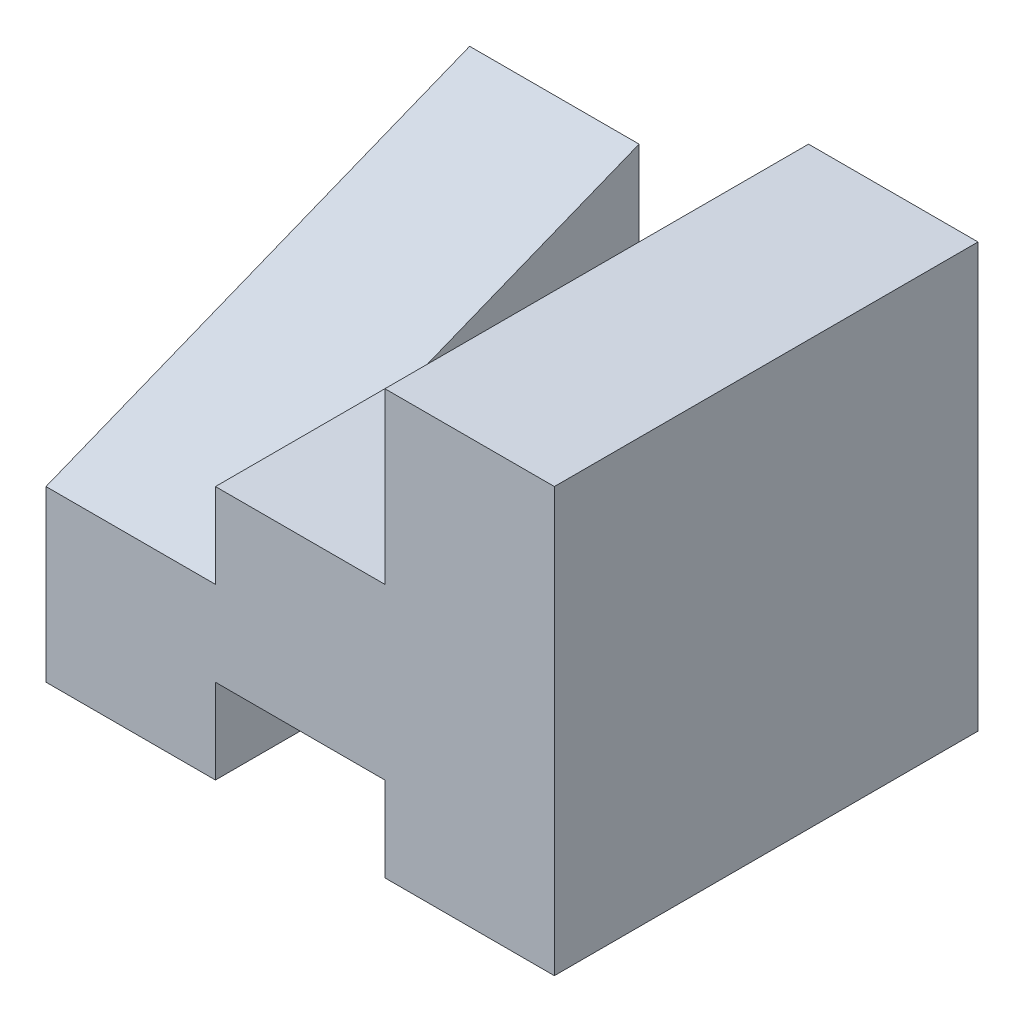
ISO-10303-21;
HEADER;
FILE_DESCRIPTION(('STEP AP214'),'2;1');
FILE_NAME('part.step','',(''),(''),'','','');
FILE_SCHEMA(('AUTOMOTIVE_DESIGN { 1 0 10303 214 1 1 1 1 }'));
ENDSEC;
DATA;
#1=APPLICATION_CONTEXT('core data for automotive mechanical design processes');
#2=APPLICATION_PROTOCOL_DEFINITION('international standard','automotive_design',2000,#1);
#3=PRODUCT_CONTEXT('',#1,'mechanical');
#4=PRODUCT('Part','Part','',(#3));
#5=PRODUCT_RELATED_PRODUCT_CATEGORY('part','',(#4));
#6=PRODUCT_DEFINITION_FORMATION('','',#4);
#7=PRODUCT_DEFINITION_CONTEXT('part definition',#1,'design');
#8=PRODUCT_DEFINITION('design','',#6,#7);
#9=PRODUCT_DEFINITION_SHAPE('','',#8);
#10=(LENGTH_UNIT() NAMED_UNIT(*) SI_UNIT(.MILLI.,.METRE.));
#11=(NAMED_UNIT(*) PLANE_ANGLE_UNIT() SI_UNIT($,.RADIAN.));
#12=(NAMED_UNIT(*) SI_UNIT($,.STERADIAN.) SOLID_ANGLE_UNIT());
#13=UNCERTAINTY_MEASURE_WITH_UNIT(LENGTH_MEASURE(1.E-05),#10,'distance_accuracy_value','');
#14=(GEOMETRIC_REPRESENTATION_CONTEXT(3) GLOBAL_UNCERTAINTY_ASSIGNED_CONTEXT((#13)) GLOBAL_UNIT_ASSIGNED_CONTEXT((#10,
#11,#12)) REPRESENTATION_CONTEXT('',''));
#15=CARTESIAN_POINT('',(0.,0.,0.));
#16=DIRECTION('',(0.,0.,1.));
#17=DIRECTION('',(1.,0.,0.));
#18=AXIS2_PLACEMENT_3D('',#15,#16,#17);
#19=CARTESIAN_POINT('',(-20.,10.,25.));
#20=DIRECTION('',(1.,0.,0.));
#21=DIRECTION('',(0.,0.,-1.));
#22=AXIS2_PLACEMENT_3D('',#19,#20,#21);
#23=PLANE('',#22);
#24=DIRECTION('',(0.,0.371390676354104,-0.928476690885259));
#25=VECTOR('',#24,1.);
#26=CARTESIAN_POINT('',(-20.,20.,0.));
#27=LINE('',#26,#25);
#28=CARTESIAN_POINT('',(-20.,10.,25.));
#29=VERTEX_POINT('',#28);
#30=CARTESIAN_POINT('',(-20.,15.,12.5));
#31=VERTEX_POINT('',#30);
#32=EDGE_CURVE('E145',#29,#31,#27,.T.);
#33=ORIENTED_EDGE('',*,*,#32,.F.);
#34=DIRECTION('',(0.,-1.,0.));
#35=VECTOR('',#34,1.);
#36=CARTESIAN_POINT('',(-20.,10.,25.));
#37=LINE('',#36,#35);
#38=CARTESIAN_POINT('',(-20.,15.,25.));
#39=VERTEX_POINT('',#38);
#40=EDGE_CURVE('E133',#39,#29,#37,.T.);
#41=ORIENTED_EDGE('',*,*,#40,.F.);
#42=DIRECTION('',(0.,0.,-1.));
#43=VECTOR('',#42,1.);
#44=CARTESIAN_POINT('',(-20.,15.,25.));
#45=LINE('',#44,#43);
#46=EDGE_CURVE('E138',#39,#31,#45,.T.);
#47=ORIENTED_EDGE('',*,*,#46,.T.);
#48=EDGE_LOOP('',(#33,#41,#47));
#49=FACE_BOUND('',#48,.T.);
#50=ADVANCED_FACE('F33',(#49),#23,.F.);
#51=CARTESIAN_POINT('',(-30.,0.,25.));
#52=DIRECTION('',(1.,0.,0.));
#53=DIRECTION('',(0.,0.,-1.));
#54=AXIS2_PLACEMENT_3D('',#51,#52,#53);
#55=PLANE('',#54);
#56=DIRECTION('',(0.,-1.,0.));
#57=VECTOR('',#56,1.);
#58=CARTESIAN_POINT('',(-30.,0.,0.));
#59=LINE('',#58,#57);
#60=CARTESIAN_POINT('',(-30.,20.,0.));
#61=VERTEX_POINT('',#60);
#62=CARTESIAN_POINT('',(-30.,0.,0.));
#63=VERTEX_POINT('',#62);
#64=EDGE_CURVE('E150',#61,#63,#59,.T.);
#65=ORIENTED_EDGE('',*,*,#64,.T.);
#66=DIRECTION('',(0.,0.,-1.));
#67=VECTOR('',#66,1.);
#68=CARTESIAN_POINT('',(-30.,0.,25.));
#69=LINE('',#68,#67);
#70=CARTESIAN_POINT('',(-30.,0.,25.));
#71=VERTEX_POINT('',#70);
#72=EDGE_CURVE('E11',#71,#63,#69,.T.);
#73=ORIENTED_EDGE('',*,*,#72,.F.);
#74=DIRECTION('',(0.,-1.,0.));
#75=VECTOR('',#74,1.);
#76=CARTESIAN_POINT('',(-30.,0.,25.));
#77=LINE('',#76,#75);
#78=CARTESIAN_POINT('',(-30.,10.,25.));
#79=VERTEX_POINT('',#78);
#80=EDGE_CURVE('E169',#79,#71,#77,.T.);
#81=ORIENTED_EDGE('',*,*,#80,.F.);
#82=DIRECTION('',(0.,0.371390676354104,-0.928476690885259));
#83=VECTOR('',#82,1.);
#84=CARTESIAN_POINT('',(-30.,20.,0.));
#85=LINE('',#84,#83);
#86=EDGE_CURVE('E239',#79,#61,#85,.T.);
#87=ORIENTED_EDGE('',*,*,#86,.T.);
#88=EDGE_LOOP('',(#65,#73,#81,#87));
#89=FACE_BOUND('',#88,.T.);
#90=ADVANCED_FACE('F35',(#89),#55,.F.);
#91=CARTESIAN_POINT('',(-20.,0.,25.));
#92=DIRECTION('',(0.,1.,0.));
#93=DIRECTION('',(-1.,0.,0.));
#94=AXIS2_PLACEMENT_3D('',#91,#92,#93);
#95=PLANE('',#94);
#96=DIRECTION('',(1.,0.,0.));
#97=VECTOR('',#96,1.);
#98=CARTESIAN_POINT('',(-20.,0.,0.));
#99=LINE('',#98,#97);
#100=CARTESIAN_POINT('',(-20.,0.,0.));
#101=VERTEX_POINT('',#100);
#102=EDGE_CURVE('E153',#63,#101,#99,.T.);
#103=ORIENTED_EDGE('',*,*,#102,.T.);
#104=DIRECTION('',(0.,0.,-1.));
#105=VECTOR('',#104,1.);
#106=CARTESIAN_POINT('',(-20.,0.,25.));
#107=LINE('',#106,#105);
#108=CARTESIAN_POINT('',(-20.,0.,25.));
#109=VERTEX_POINT('',#108);
#110=EDGE_CURVE('E41',#109,#101,#107,.T.);
#111=ORIENTED_EDGE('',*,*,#110,.F.);
#112=DIRECTION('',(1.,0.,0.));
#113=VECTOR('',#112,1.);
#114=CARTESIAN_POINT('',(-20.,0.,25.));
#115=LINE('',#114,#113);
#116=EDGE_CURVE('E102',#71,#109,#115,.T.);
#117=ORIENTED_EDGE('',*,*,#116,.F.);
#118=ORIENTED_EDGE('',*,*,#72,.T.);
#119=EDGE_LOOP('',(#103,#111,#117,#118));
#120=FACE_BOUND('',#119,.T.);
#121=ADVANCED_FACE('F252',(#120),#95,.F.);
#122=CARTESIAN_POINT('',(-20.,5.,25.));
#123=DIRECTION('',(-1.,0.,0.));
#124=DIRECTION('',(0.,0.,1.));
#125=AXIS2_PLACEMENT_3D('',#122,#123,#124);
#126=PLANE('',#125);
#127=DIRECTION('',(0.,1.,0.));
#128=VECTOR('',#127,1.);
#129=CARTESIAN_POINT('',(-20.,5.,0.));
#130=LINE('',#129,#128);
#131=CARTESIAN_POINT('',(-20.,5.,0.));
#132=VERTEX_POINT('',#131);
#133=EDGE_CURVE('E155',#101,#132,#130,.T.);
#134=ORIENTED_EDGE('',*,*,#133,.T.);
#135=DIRECTION('',(0.,0.,-1.));
#136=VECTOR('',#135,1.);
#137=CARTESIAN_POINT('',(-20.,5.,25.));
#138=LINE('',#137,#136);
#139=CARTESIAN_POINT('',(-20.,5.,25.));
#140=VERTEX_POINT('',#139);
#141=EDGE_CURVE('E187',#140,#132,#138,.T.);
#142=ORIENTED_EDGE('',*,*,#141,.F.);
#143=DIRECTION('',(0.,1.,0.));
#144=VECTOR('',#143,1.);
#145=CARTESIAN_POINT('',(-20.,5.,25.));
#146=LINE('',#145,#144);
#147=EDGE_CURVE('E195',#109,#140,#146,.T.);
#148=ORIENTED_EDGE('',*,*,#147,.F.);
#149=ORIENTED_EDGE('',*,*,#110,.T.);
#150=EDGE_LOOP('',(#134,#142,#148,#149));
#151=FACE_BOUND('',#150,.T.);
#152=ADVANCED_FACE('F193',(#151),#126,.F.);
#153=CARTESIAN_POINT('',(-10.,5.,25.));
#154=DIRECTION('',(0.,1.,0.));
#155=DIRECTION('',(-1.,0.,0.));
#156=AXIS2_PLACEMENT_3D('',#153,#154,#155);
#157=PLANE('',#156);
#158=DIRECTION('',(1.,0.,0.));
#159=VECTOR('',#158,1.);
#160=CARTESIAN_POINT('',(-10.,5.,0.));
#161=LINE('',#160,#159);
#162=CARTESIAN_POINT('',(-10.,5.,0.));
#163=VERTEX_POINT('',#162);
#164=EDGE_CURVE('E157',#132,#163,#161,.T.);
#165=ORIENTED_EDGE('',*,*,#164,.T.);
#166=DIRECTION('',(0.,0.,-1.));
#167=VECTOR('',#166,1.);
#168=CARTESIAN_POINT('',(-10.,5.,25.));
#169=LINE('',#168,#167);
#170=CARTESIAN_POINT('',(-10.,5.,25.));
#171=VERTEX_POINT('',#170);
#172=EDGE_CURVE('E184',#171,#163,#169,.T.);
#173=ORIENTED_EDGE('',*,*,#172,.F.);
#174=DIRECTION('',(1.,0.,0.));
#175=VECTOR('',#174,1.);
#176=CARTESIAN_POINT('',(-10.,5.,25.));
#177=LINE('',#176,#175);
#178=EDGE_CURVE('E213',#140,#171,#177,.T.);
#179=ORIENTED_EDGE('',*,*,#178,.F.);
#180=ORIENTED_EDGE('',*,*,#141,.T.);
#181=EDGE_LOOP('',(#165,#173,#179,#180));
#182=FACE_BOUND('',#181,.T.);
#183=ADVANCED_FACE('F204',(#182),#157,.F.);
#184=CARTESIAN_POINT('',(-10.,0.,25.));
#185=DIRECTION('',(1.,0.,0.));
#186=DIRECTION('',(0.,0.,-1.));
#187=AXIS2_PLACEMENT_3D('',#184,#185,#186);
#188=PLANE('',#187);
#189=DIRECTION('',(0.,-1.,0.));
#190=VECTOR('',#189,1.);
#191=CARTESIAN_POINT('',(-10.,0.,0.));
#192=LINE('',#191,#190);
#193=CARTESIAN_POINT('',(-10.,0.,0.));
#194=VERTEX_POINT('',#193);
#195=EDGE_CURVE('E159',#163,#194,#192,.T.);
#196=ORIENTED_EDGE('',*,*,#195,.T.);
#197=DIRECTION('',(0.,0.,-1.));
#198=VECTOR('',#197,1.);
#199=CARTESIAN_POINT('',(-10.,0.,25.));
#200=LINE('',#199,#198);
#201=CARTESIAN_POINT('',(-10.,0.,25.));
#202=VERTEX_POINT('',#201);
#203=EDGE_CURVE('E181',#202,#194,#200,.T.);
#204=ORIENTED_EDGE('',*,*,#203,.F.);
#205=DIRECTION('',(0.,-1.,0.));
#206=VECTOR('',#205,1.);
#207=CARTESIAN_POINT('',(-10.,0.,25.));
#208=LINE('',#207,#206);
#209=EDGE_CURVE('E210',#171,#202,#208,.T.);
#210=ORIENTED_EDGE('',*,*,#209,.F.);
#211=ORIENTED_EDGE('',*,*,#172,.T.);
#212=EDGE_LOOP('',(#196,#204,#210,#211));
#213=FACE_BOUND('',#212,.T.);
#214=ADVANCED_FACE('F208',(#213),#188,.F.);
#215=CARTESIAN_POINT('',(0.,0.,25.));
#216=DIRECTION('',(0.,1.,0.));
#217=DIRECTION('',(-1.,0.,0.));
#218=AXIS2_PLACEMENT_3D('',#215,#216,#217);
#219=PLANE('',#218);
#220=DIRECTION('',(1.,0.,0.));
#221=VECTOR('',#220,1.);
#222=CARTESIAN_POINT('',(0.,0.,0.));
#223=LINE('',#222,#221);
#224=CARTESIAN_POINT('',(0.,0.,0.));
#225=VERTEX_POINT('',#224);
#226=EDGE_CURVE('E161',#194,#225,#223,.T.);
#227=ORIENTED_EDGE('',*,*,#226,.T.);
#228=DIRECTION('',(0.,0.,-1.));
#229=VECTOR('',#228,1.);
#230=CARTESIAN_POINT('',(0.,0.,25.));
#231=LINE('',#230,#229);
#232=CARTESIAN_POINT('',(0.,0.,25.));
#233=VERTEX_POINT('',#232);
#234=EDGE_CURVE('E178',#233,#225,#231,.T.);
#235=ORIENTED_EDGE('',*,*,#234,.F.);
#236=DIRECTION('',(1.,0.,0.));
#237=VECTOR('',#236,1.);
#238=CARTESIAN_POINT('',(0.,0.,25.));
#239=LINE('',#238,#237);
#240=EDGE_CURVE('E212',#202,#233,#239,.T.);
#241=ORIENTED_EDGE('',*,*,#240,.F.);
#242=ORIENTED_EDGE('',*,*,#203,.T.);
#243=EDGE_LOOP('',(#227,#235,#241,#242));
#244=FACE_BOUND('',#243,.T.);
#245=ADVANCED_FACE('F275',(#244),#219,.F.);
#246=CARTESIAN_POINT('',(0.,25.,25.));
#247=DIRECTION('',(-1.,0.,0.));
#248=DIRECTION('',(0.,-1.,0.));
#249=AXIS2_PLACEMENT_3D('',#246,#247,#248);
#250=PLANE('',#249);
#251=DIRECTION('',(0.,1.,0.));
#252=VECTOR('',#251,1.);
#253=CARTESIAN_POINT('',(0.,25.,0.));
#254=LINE('',#253,#252);
#255=CARTESIAN_POINT('',(0.,25.,0.));
#256=VERTEX_POINT('',#255);
#257=EDGE_CURVE('E163',#225,#256,#254,.T.);
#258=ORIENTED_EDGE('',*,*,#257,.T.);
#259=DIRECTION('',(0.,0.,-1.));
#260=VECTOR('',#259,1.);
#261=CARTESIAN_POINT('',(0.,25.,25.));
#262=LINE('',#261,#260);
#263=CARTESIAN_POINT('',(0.,25.,25.));
#264=VERTEX_POINT('',#263);
#265=EDGE_CURVE('E175',#264,#256,#262,.T.);
#266=ORIENTED_EDGE('',*,*,#265,.F.);
#267=DIRECTION('',(0.,1.,0.));
#268=VECTOR('',#267,1.);
#269=CARTESIAN_POINT('',(0.,25.,25.));
#270=LINE('',#269,#268);
#271=EDGE_CURVE('E215',#233,#264,#270,.T.);
#272=ORIENTED_EDGE('',*,*,#271,.F.);
#273=ORIENTED_EDGE('',*,*,#234,.T.);
#274=EDGE_LOOP('',(#258,#266,#272,#273));
#275=FACE_BOUND('',#274,.T.);
#276=ADVANCED_FACE('F272',(#275),#250,.F.);
#277=CARTESIAN_POINT('',(-10.,25.,25.));
#278=DIRECTION('',(0.,-1.,0.));
#279=DIRECTION('',(0.,0.,-1.));
#280=AXIS2_PLACEMENT_3D('',#277,#278,#279);
#281=PLANE('',#280);
#282=DIRECTION('',(-1.,0.,0.));
#283=VECTOR('',#282,1.);
#284=CARTESIAN_POINT('',(-10.,25.,0.));
#285=LINE('',#284,#283);
#286=CARTESIAN_POINT('',(-10.,25.,0.));
#287=VERTEX_POINT('',#286);
#288=EDGE_CURVE('E165',#256,#287,#285,.T.);
#289=ORIENTED_EDGE('',*,*,#288,.T.);
#290=DIRECTION('',(0.,0.,-1.));
#291=VECTOR('',#290,1.);
#292=CARTESIAN_POINT('',(-10.,25.,25.));
#293=LINE('',#292,#291);
#294=CARTESIAN_POINT('',(-10.,25.,25.));
#295=VERTEX_POINT('',#294);
#296=EDGE_CURVE('E172',#295,#287,#293,.T.);
#297=ORIENTED_EDGE('',*,*,#296,.F.);
#298=DIRECTION('',(-1.,0.,0.));
#299=VECTOR('',#298,1.);
#300=CARTESIAN_POINT('',(-10.,25.,25.));
#301=LINE('',#300,#299);
#302=EDGE_CURVE('E221',#264,#295,#301,.T.);
#303=ORIENTED_EDGE('',*,*,#302,.F.);
#304=ORIENTED_EDGE('',*,*,#265,.T.);
#305=EDGE_LOOP('',(#289,#297,#303,#304));
#306=FACE_BOUND('',#305,.T.);
#307=ADVANCED_FACE('F227',(#306),#281,.F.);
#308=CARTESIAN_POINT('',(-10.,15.,25.));
#309=DIRECTION('',(1.,0.,0.));
#310=DIRECTION('',(0.,0.,-1.));
#311=AXIS2_PLACEMENT_3D('',#308,#309,#310);
#312=PLANE('',#311);
#313=DIRECTION('',(0.,-1.,0.));
#314=VECTOR('',#313,1.);
#315=CARTESIAN_POINT('',(-10.,15.,0.));
#316=LINE('',#315,#314);
#317=CARTESIAN_POINT('',(-10.,15.,0.));
#318=VERTEX_POINT('',#317);
#319=EDGE_CURVE('E167',#287,#318,#316,.T.);
#320=ORIENTED_EDGE('',*,*,#319,.T.);
#321=DIRECTION('',(0.,0.,-1.));
#322=VECTOR('',#321,1.);
#323=CARTESIAN_POINT('',(-10.,15.,25.));
#324=LINE('',#323,#322);
#325=CARTESIAN_POINT('',(-10.,15.,25.));
#326=VERTEX_POINT('',#325);
#327=EDGE_CURVE('E142',#326,#318,#324,.T.);
#328=ORIENTED_EDGE('',*,*,#327,.F.);
#329=DIRECTION('',(0.,-1.,0.));
#330=VECTOR('',#329,1.);
#331=CARTESIAN_POINT('',(-10.,15.,25.));
#332=LINE('',#331,#330);
#333=EDGE_CURVE('E135',#295,#326,#332,.T.);
#334=ORIENTED_EDGE('',*,*,#333,.F.);
#335=ORIENTED_EDGE('',*,*,#296,.T.);
#336=EDGE_LOOP('',(#320,#328,#334,#335));
#337=FACE_BOUND('',#336,.T.);
#338=ADVANCED_FACE('F231',(#337),#312,.F.);
#339=CARTESIAN_POINT('',(-20.,15.,25.));
#340=DIRECTION('',(0.,-1.,0.));
#341=DIRECTION('',(0.,0.,-1.));
#342=AXIS2_PLACEMENT_3D('',#339,#340,#341);
#343=PLANE('',#342);
#344=DIRECTION('',(-1.,0.,0.));
#345=VECTOR('',#344,1.);
#346=CARTESIAN_POINT('',(-20.,15.,0.));
#347=LINE('',#346,#345);
#348=CARTESIAN_POINT('',(-20.,15.,0.));
#349=VERTEX_POINT('',#348);
#350=EDGE_CURVE('E95',#318,#349,#347,.T.);
#351=ORIENTED_EDGE('',*,*,#350,.T.);
#352=DIRECTION('',(0.,0.,1.));
#353=VECTOR('',#352,1.);
#354=CARTESIAN_POINT('',(-20.,15.,25.));
#355=LINE('',#354,#353);
#356=EDGE_CURVE('E48',#349,#31,#355,.T.);
#357=ORIENTED_EDGE('',*,*,#356,.T.);
#358=ORIENTED_EDGE('',*,*,#46,.F.);
#359=DIRECTION('',(-1.,0.,0.));
#360=VECTOR('',#359,1.);
#361=CARTESIAN_POINT('',(-20.,15.,25.));
#362=LINE('',#361,#360);
#363=EDGE_CURVE('E130',#326,#39,#362,.T.);
#364=ORIENTED_EDGE('',*,*,#363,.F.);
#365=ORIENTED_EDGE('',*,*,#327,.T.);
#366=EDGE_LOOP('',(#351,#357,#358,#364,#365));
#367=FACE_BOUND('',#366,.T.);
#368=ADVANCED_FACE('F139',(#367),#343,.F.);
#369=CARTESIAN_POINT('',(0.,0.,25.));
#370=DIRECTION('',(0.,0.,-1.));
#371=DIRECTION('',(-1.,0.,0.));
#372=AXIS2_PLACEMENT_3D('',#369,#370,#371);
#373=PLANE('',#372);
#374=ORIENTED_EDGE('',*,*,#80,.T.);
#375=ORIENTED_EDGE('',*,*,#116,.T.);
#376=ORIENTED_EDGE('',*,*,#147,.T.);
#377=ORIENTED_EDGE('',*,*,#178,.T.);
#378=ORIENTED_EDGE('',*,*,#209,.T.);
#379=ORIENTED_EDGE('',*,*,#240,.T.);
#380=ORIENTED_EDGE('',*,*,#271,.T.);
#381=ORIENTED_EDGE('',*,*,#302,.T.);
#382=ORIENTED_EDGE('',*,*,#333,.T.);
#383=ORIENTED_EDGE('',*,*,#363,.T.);
#384=ORIENTED_EDGE('',*,*,#40,.T.);
#385=DIRECTION('',(-1.,0.,0.));
#386=VECTOR('',#385,1.);
#387=CARTESIAN_POINT('',(-30.,10.,25.));
#388=LINE('',#387,#386);
#389=EDGE_CURVE('E57',#29,#79,#388,.T.);
#390=ORIENTED_EDGE('',*,*,#389,.T.);
#391=EDGE_LOOP('',(#374,#375,#376,#377,#378,#379,#380,#381,#382,#383,#384,#390));
#392=FACE_BOUND('',#391,.T.);
#393=ADVANCED_FACE('F131',(#392),#373,.F.);
#394=CARTESIAN_POINT('',(0.,0.,0.));
#395=DIRECTION('',(0.,0.,-1.));
#396=DIRECTION('',(-1.,0.,0.));
#397=AXIS2_PLACEMENT_3D('',#394,#395,#396);
#398=PLANE('',#397);
#399=ORIENTED_EDGE('',*,*,#64,.F.);
#400=DIRECTION('',(1.,0.,0.));
#401=VECTOR('',#400,1.);
#402=CARTESIAN_POINT('',(-30.,20.,0.));
#403=LINE('',#402,#401);
#404=CARTESIAN_POINT('',(-20.,20.,0.));
#405=VERTEX_POINT('',#404);
#406=EDGE_CURVE('E237',#61,#405,#403,.T.);
#407=ORIENTED_EDGE('',*,*,#406,.T.);
#408=DIRECTION('',(0.,-1.,0.));
#409=VECTOR('',#408,1.);
#410=CARTESIAN_POINT('',(-20.,10.,0.));
#411=LINE('',#410,#409);
#412=EDGE_CURVE('E235',#405,#349,#411,.T.);
#413=ORIENTED_EDGE('',*,*,#412,.T.);
#414=ORIENTED_EDGE('',*,*,#350,.F.);
#415=ORIENTED_EDGE('',*,*,#319,.F.);
#416=ORIENTED_EDGE('',*,*,#288,.F.);
#417=ORIENTED_EDGE('',*,*,#257,.F.);
#418=ORIENTED_EDGE('',*,*,#226,.F.);
#419=ORIENTED_EDGE('',*,*,#195,.F.);
#420=ORIENTED_EDGE('',*,*,#164,.F.);
#421=ORIENTED_EDGE('',*,*,#133,.F.);
#422=ORIENTED_EDGE('',*,*,#102,.F.);
#423=EDGE_LOOP('',(#399,#407,#413,#414,#415,#416,#417,#418,#419,#420,#421,#422));
#424=FACE_BOUND('',#423,.T.);
#425=ADVANCED_FACE('F199',(#424),#398,.T.);
#426=CARTESIAN_POINT('',(-20.,0.,0.));
#427=DIRECTION('',(1.,0.,0.));
#428=DIRECTION('',(0.,0.,-1.));
#429=AXIS2_PLACEMENT_3D('',#426,#427,#428);
#430=PLANE('',#429);
#431=ORIENTED_EDGE('',*,*,#356,.F.);
#432=ORIENTED_EDGE('',*,*,#412,.F.);
#433=EDGE_CURVE('E243',#31,#405,#27,.T.);
#434=ORIENTED_EDGE('',*,*,#433,.F.);
#435=EDGE_LOOP('',(#431,#432,#434));
#436=FACE_BOUND('',#435,.T.);
#437=ADVANCED_FACE('F323',(#436),#430,.T.);
#438=CARTESIAN_POINT('',(-30.,20.,0.));
#439=DIRECTION('',(0.,-0.928476690885259,-0.371390676354104));
#440=DIRECTION('',(0.,0.371390676354104,-0.928476690885259));
#441=AXIS2_PLACEMENT_3D('',#438,#439,#440);
#442=PLANE('',#441);
#443=ORIENTED_EDGE('',*,*,#32,.T.);
#444=ORIENTED_EDGE('',*,*,#433,.T.);
#445=ORIENTED_EDGE('',*,*,#406,.F.);
#446=ORIENTED_EDGE('',*,*,#86,.F.);
#447=ORIENTED_EDGE('',*,*,#389,.F.);
#448=EDGE_LOOP('',(#443,#444,#445,#446,#447));
#449=FACE_BOUND('',#448,.T.);
#450=ADVANCED_FACE('F329',(#449),#442,.F.);
#451=CLOSED_SHELL('',(#50,#90,#121,#152,#183,#214,#245,#276,#307,#338,#368,#393,#425,#437,#450));
#452=MANIFOLD_SOLID_BREP('B2',#451);
#453=ADVANCED_BREP_SHAPE_REPRESENTATION('',(#18,#452),#14);
#454=SHAPE_DEFINITION_REPRESENTATION(#9,#453);
ENDSEC;
END-ISO-10303-21;
